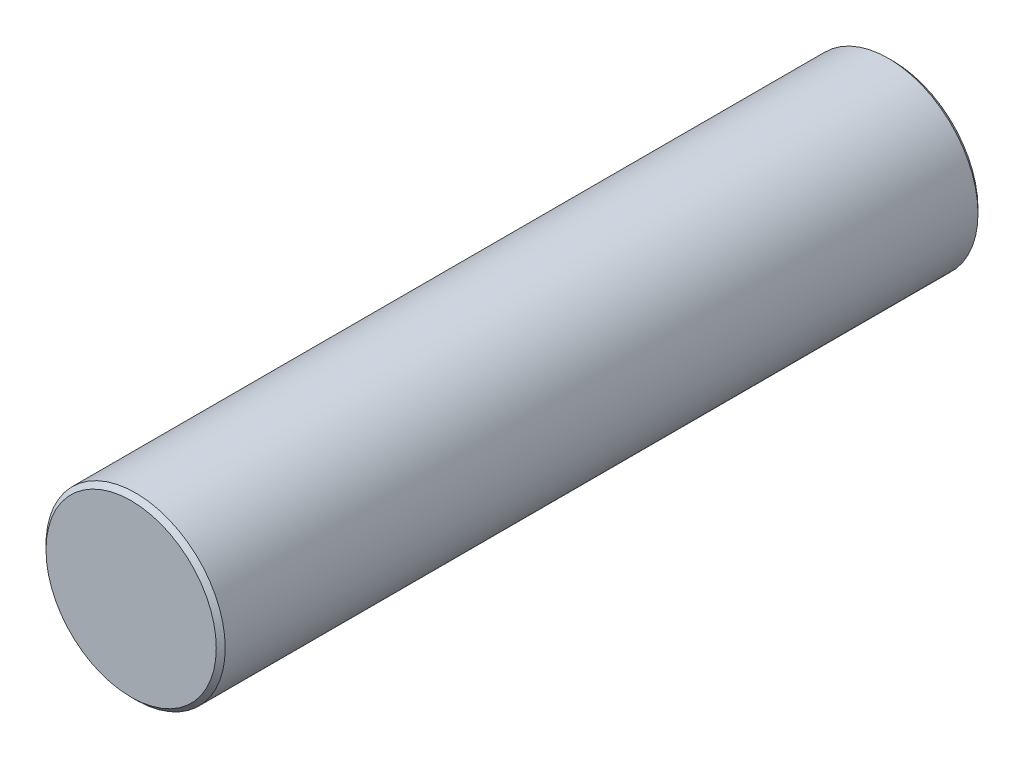
ISO-10303-21;
HEADER;
FILE_DESCRIPTION(('STEP AP214'),'2;1');
FILE_NAME('part.step','',(''),(''),'','','');
FILE_SCHEMA(('AUTOMOTIVE_DESIGN { 1 0 10303 214 1 1 1 1 }'));
ENDSEC;
DATA;
#1=APPLICATION_CONTEXT('core data for automotive mechanical design processes');
#2=APPLICATION_PROTOCOL_DEFINITION('international standard','automotive_design',2000,#1);
#3=PRODUCT_CONTEXT('',#1,'mechanical');
#4=PRODUCT('Part','Part','',(#3));
#5=PRODUCT_RELATED_PRODUCT_CATEGORY('part','',(#4));
#6=PRODUCT_DEFINITION_FORMATION('','',#4);
#7=PRODUCT_DEFINITION_CONTEXT('part definition',#1,'design');
#8=PRODUCT_DEFINITION('design','',#6,#7);
#9=PRODUCT_DEFINITION_SHAPE('','',#8);
#10=(LENGTH_UNIT() NAMED_UNIT(*) SI_UNIT(.MILLI.,.METRE.));
#11=(NAMED_UNIT(*) PLANE_ANGLE_UNIT() SI_UNIT($,.RADIAN.));
#12=(NAMED_UNIT(*) SI_UNIT($,.STERADIAN.) SOLID_ANGLE_UNIT());
#13=UNCERTAINTY_MEASURE_WITH_UNIT(LENGTH_MEASURE(1.E-05),#10,'distance_accuracy_value','');
#14=(GEOMETRIC_REPRESENTATION_CONTEXT(3) GLOBAL_UNCERTAINTY_ASSIGNED_CONTEXT((#13)) GLOBAL_UNIT_ASSIGNED_CONTEXT((#10,
#11,#12)) REPRESENTATION_CONTEXT('',''));
#15=CARTESIAN_POINT('',(0.,0.,0.));
#16=DIRECTION('',(0.,0.,1.));
#17=DIRECTION('',(1.,0.,0.));
#18=AXIS2_PLACEMENT_3D('',#15,#16,#17);
#19=CARTESIAN_POINT('',(0.,0.,170.));
#20=DIRECTION('',(0.,0.,-1.));
#21=DIRECTION('',(-1.,0.,0.));
#22=AXIS2_PLACEMENT_3D('',#19,#20,#21);
#23=CYLINDRICAL_SURFACE('',#22,20.);
#24=CARTESIAN_POINT('',(0.,0.,1.));
#25=DIRECTION('',(0.,0.,1.));
#26=DIRECTION('',(1.,0.,0.));
#27=AXIS2_PLACEMENT_3D('',#24,#25,#26);
#28=CIRCLE('',#27,20.);
#29=CARTESIAN_POINT('',(20.,0.,1.));
#30=VERTEX_POINT('',#29);
#31=EDGE_CURVE('E52',#30,#30,#28,.T.);
#32=ORIENTED_EDGE('',*,*,#31,.T.);
#33=EDGE_LOOP('',(#32));
#34=FACE_BOUND('',#33,.T.);
#35=CARTESIAN_POINT('',(0.,0.,169.));
#36=DIRECTION('',(0.,0.,1.));
#37=DIRECTION('',(1.,0.,0.));
#38=AXIS2_PLACEMENT_3D('',#35,#36,#37);
#39=CIRCLE('',#38,20.);
#40=CARTESIAN_POINT('',(20.,0.,169.));
#41=VERTEX_POINT('',#40);
#42=EDGE_CURVE('E57',#41,#41,#39,.F.);
#43=ORIENTED_EDGE('',*,*,#42,.T.);
#44=EDGE_LOOP('',(#43));
#45=FACE_BOUND('',#44,.T.);
#46=ADVANCED_FACE('F39',(#34,#45),#23,.T.);
#47=CARTESIAN_POINT('',(0.,0.,170.));
#48=DIRECTION('',(0.,0.,1.));
#49=DIRECTION('',(1.,0.,0.));
#50=AXIS2_PLACEMENT_3D('',#47,#48,#49);
#51=PLANE('',#50);
#52=CARTESIAN_POINT('',(0.,0.,170.));
#53=DIRECTION('',(0.,0.,1.));
#54=DIRECTION('',(1.,0.,0.));
#55=AXIS2_PLACEMENT_3D('',#52,#53,#54);
#56=CIRCLE('',#55,19.);
#57=CARTESIAN_POINT('',(19.,0.,170.));
#58=VERTEX_POINT('',#57);
#59=EDGE_CURVE('E10',#58,#58,#56,.T.);
#60=ORIENTED_EDGE('',*,*,#59,.T.);
#61=EDGE_LOOP('',(#60));
#62=FACE_BOUND('',#61,.T.);
#63=ADVANCED_FACE('F74',(#62),#51,.T.);
#64=CARTESIAN_POINT('',(0.,0.,0.));
#65=DIRECTION('',(0.,0.,1.));
#66=DIRECTION('',(1.,0.,0.));
#67=AXIS2_PLACEMENT_3D('',#64,#65,#66);
#68=PLANE('',#67);
#69=CARTESIAN_POINT('',(0.,0.,0.));
#70=DIRECTION('',(0.,0.,1.));
#71=DIRECTION('',(1.,0.,0.));
#72=AXIS2_PLACEMENT_3D('',#69,#70,#71);
#73=CIRCLE('',#72,19.);
#74=CARTESIAN_POINT('',(19.,0.,0.));
#75=VERTEX_POINT('',#74);
#76=EDGE_CURVE('E47',#75,#75,#73,.F.);
#77=ORIENTED_EDGE('',*,*,#76,.T.);
#78=EDGE_LOOP('',(#77));
#79=FACE_BOUND('',#78,.T.);
#80=ADVANCED_FACE('F71',(#79),#68,.F.);
#81=CARTESIAN_POINT('',(0.,0.,1.));
#82=DIRECTION('',(0.,0.,1.));
#83=DIRECTION('',(1.,0.,0.));
#84=AXIS2_PLACEMENT_3D('',#81,#82,#83);
#85=CONICAL_SURFACE('',#84,20.,0.78539816339744);
#86=ORIENTED_EDGE('',*,*,#76,.F.);
#87=EDGE_LOOP('',(#86));
#88=FACE_BOUND('',#87,.T.);
#89=ORIENTED_EDGE('',*,*,#31,.F.);
#90=EDGE_LOOP('',(#89));
#91=FACE_BOUND('',#90,.T.);
#92=ADVANCED_FACE('F67',(#88,#91),#85,.T.);
#93=CARTESIAN_POINT('',(0.,0.,170.));
#94=DIRECTION('',(0.,0.,-1.));
#95=DIRECTION('',(-1.,0.,0.));
#96=AXIS2_PLACEMENT_3D('',#93,#94,#95);
#97=CONICAL_SURFACE('',#96,19.,0.78539816339744);
#98=ORIENTED_EDGE('',*,*,#42,.F.);
#99=EDGE_LOOP('',(#98));
#100=FACE_BOUND('',#99,.T.);
#101=ORIENTED_EDGE('',*,*,#59,.F.);
#102=EDGE_LOOP('',(#101));
#103=FACE_BOUND('',#102,.T.);
#104=ADVANCED_FACE('F41',(#100,#103),#97,.T.);
#105=CLOSED_SHELL('',(#46,#63,#80,#92,#104));
#106=MANIFOLD_SOLID_BREP('B2',#105);
#107=ADVANCED_BREP_SHAPE_REPRESENTATION('',(#18,#106),#14);
#108=SHAPE_DEFINITION_REPRESENTATION(#9,#107);
ENDSEC;
END-ISO-10303-21;
